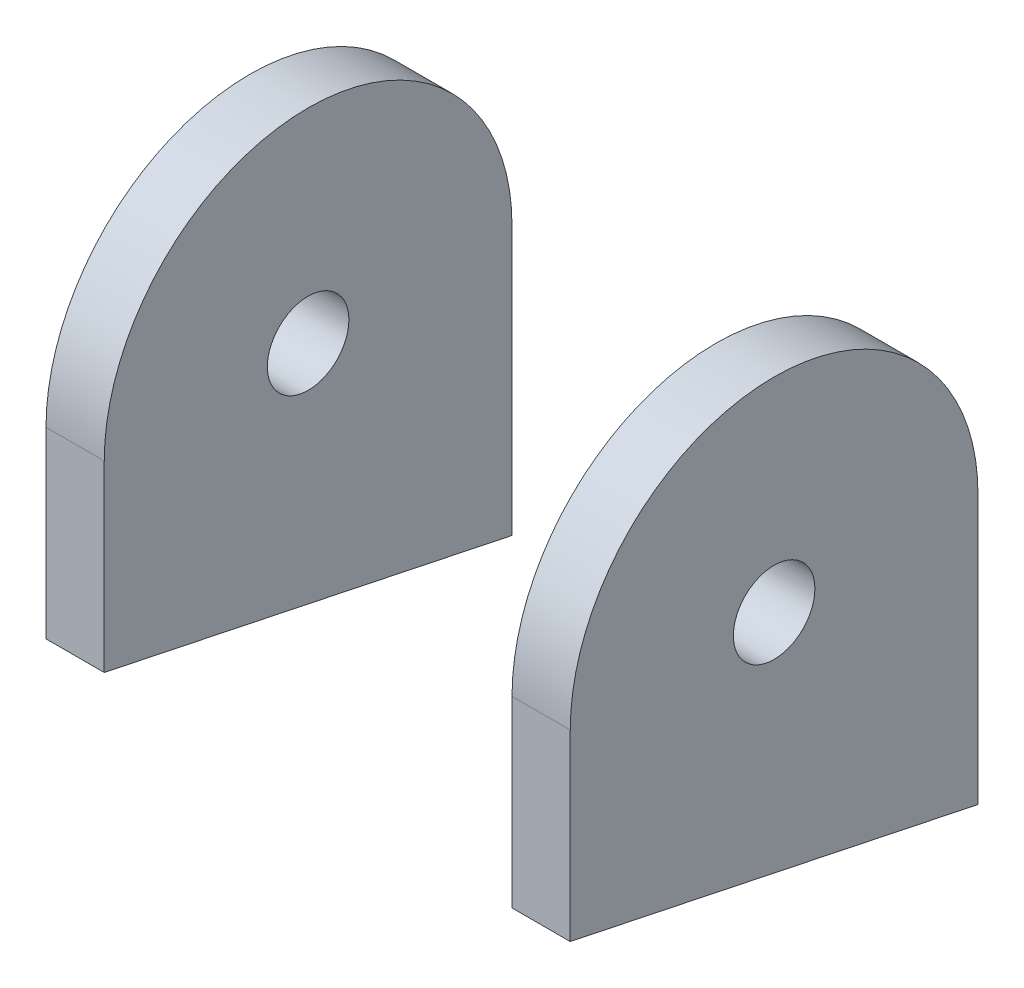
ISO-10303-21;
HEADER;
FILE_DESCRIPTION(('STEP AP214'),'2;1');
FILE_NAME('part.step','',(''),(''),'','','');
FILE_SCHEMA(('AUTOMOTIVE_DESIGN { 1 0 10303 214 1 1 1 1 }'));
ENDSEC;
DATA;
#1=APPLICATION_CONTEXT('core data for automotive mechanical design processes');
#2=APPLICATION_PROTOCOL_DEFINITION('international standard','automotive_design',2000,#1);
#3=PRODUCT_CONTEXT('',#1,'mechanical');
#4=PRODUCT('Part','Part','',(#3));
#5=PRODUCT_RELATED_PRODUCT_CATEGORY('part','',(#4));
#6=PRODUCT_DEFINITION_FORMATION('','',#4);
#7=PRODUCT_DEFINITION_CONTEXT('part definition',#1,'design');
#8=PRODUCT_DEFINITION('design','',#6,#7);
#9=PRODUCT_DEFINITION_SHAPE('','',#8);
#10=(LENGTH_UNIT() NAMED_UNIT(*) SI_UNIT(.MILLI.,.METRE.));
#11=(NAMED_UNIT(*) PLANE_ANGLE_UNIT() SI_UNIT($,.RADIAN.));
#12=(NAMED_UNIT(*) SI_UNIT($,.STERADIAN.) SOLID_ANGLE_UNIT());
#13=UNCERTAINTY_MEASURE_WITH_UNIT(LENGTH_MEASURE(1.E-05),#10,'distance_accuracy_value','');
#14=(GEOMETRIC_REPRESENTATION_CONTEXT(3) GLOBAL_UNCERTAINTY_ASSIGNED_CONTEXT((#13)) GLOBAL_UNIT_ASSIGNED_CONTEXT((#10,
#11,#12)) REPRESENTATION_CONTEXT('',''));
#15=CARTESIAN_POINT('',(0.,0.,0.));
#16=DIRECTION('',(0.,0.,1.));
#17=DIRECTION('',(1.,0.,0.));
#18=AXIS2_PLACEMENT_3D('',#15,#16,#17);
#19=CARTESIAN_POINT('',(-80.,0.,0.));
#20=DIRECTION('',(1.,0.,0.));
#21=DIRECTION('',(0.,0.,-1.));
#22=AXIS2_PLACEMENT_3D('',#19,#20,#21);
#23=CYLINDRICAL_SURFACE('',#22,35.);
#24=DIRECTION('',(1.,0.,0.));
#25=VECTOR('',#24,1.);
#26=CARTESIAN_POINT('',(-80.,0.,35.));
#27=LINE('',#26,#25);
#28=CARTESIAN_POINT('',(-80.,0.,35.));
#29=VERTEX_POINT('',#28);
#30=CARTESIAN_POINT('',(-70.,0.,35.));
#31=VERTEX_POINT('',#30);
#32=EDGE_CURVE('E111',#29,#31,#27,.T.);
#33=ORIENTED_EDGE('',*,*,#32,.T.);
#34=CARTESIAN_POINT('',(-70.,0.,0.));
#35=DIRECTION('',(1.,0.,0.));
#36=DIRECTION('',(0.,0.,-1.));
#37=AXIS2_PLACEMENT_3D('',#34,#35,#36);
#38=CIRCLE('',#37,35.);
#39=CARTESIAN_POINT('',(-70.,0.,-35.));
#40=VERTEX_POINT('',#39);
#41=EDGE_CURVE('E97',#40,#31,#38,.T.);
#42=ORIENTED_EDGE('',*,*,#41,.F.);
#43=DIRECTION('',(1.,0.,0.));
#44=VECTOR('',#43,1.);
#45=CARTESIAN_POINT('',(-80.,0.,-35.));
#46=LINE('',#45,#44);
#47=CARTESIAN_POINT('',(-80.,0.,-35.));
#48=VERTEX_POINT('',#47);
#49=EDGE_CURVE('E107',#48,#40,#46,.T.);
#50=ORIENTED_EDGE('',*,*,#49,.F.);
#51=CARTESIAN_POINT('',(-80.,0.,0.));
#52=DIRECTION('',(1.,0.,0.));
#53=DIRECTION('',(0.,0.,-1.));
#54=AXIS2_PLACEMENT_3D('',#51,#52,#53);
#55=CIRCLE('',#54,35.);
#56=EDGE_CURVE('E110',#48,#29,#55,.T.);
#57=ORIENTED_EDGE('',*,*,#56,.T.);
#58=EDGE_LOOP('',(#33,#42,#50,#57));
#59=FACE_BOUND('',#58,.T.);
#60=ADVANCED_FACE('F45',(#59),#23,.T.);
#61=CARTESIAN_POINT('',(-80.,0.,-35.));
#62=DIRECTION('',(0.,0.,-1.));
#63=DIRECTION('',(0.,1.,0.));
#64=AXIS2_PLACEMENT_3D('',#61,#62,#63);
#65=PLANE('',#64);
#66=DIRECTION('',(1.,0.,0.));
#67=VECTOR('',#66,1.);
#68=CARTESIAN_POINT('',(-80.,-46.0800024246072,-35.));
#69=LINE('',#68,#67);
#70=CARTESIAN_POINT('',(-80.,-46.0800024246072,-35.));
#71=VERTEX_POINT('',#70);
#72=CARTESIAN_POINT('',(-70.,-46.0800024246072,-35.));
#73=VERTEX_POINT('',#72);
#74=EDGE_CURVE('E59',#71,#73,#69,.T.);
#75=ORIENTED_EDGE('',*,*,#74,.F.);
#76=DIRECTION('',(0.,1.,0.));
#77=VECTOR('',#76,1.);
#78=CARTESIAN_POINT('',(-80.,0.,-35.));
#79=LINE('',#78,#77);
#80=EDGE_CURVE('E109',#71,#48,#79,.T.);
#81=ORIENTED_EDGE('',*,*,#80,.T.);
#82=ORIENTED_EDGE('',*,*,#49,.T.);
#83=DIRECTION('',(0.,1.,0.));
#84=VECTOR('',#83,1.);
#85=CARTESIAN_POINT('',(-70.,0.,-35.));
#86=LINE('',#85,#84);
#87=EDGE_CURVE('E53',#73,#40,#86,.T.);
#88=ORIENTED_EDGE('',*,*,#87,.F.);
#89=EDGE_LOOP('',(#75,#81,#82,#88));
#90=FACE_BOUND('',#89,.T.);
#91=ADVANCED_FACE('F140',(#90),#65,.T.);
#92=CARTESIAN_POINT('',(-80.,0.,35.));
#93=DIRECTION('',(0.,0.,1.));
#94=DIRECTION('',(1.,0.,0.));
#95=AXIS2_PLACEMENT_3D('',#92,#93,#94);
#96=PLANE('',#95);
#97=DIRECTION('',(-1.,0.,0.));
#98=VECTOR('',#97,1.);
#99=CARTESIAN_POINT('',(-80.,-31.4519974855182,35.));
#100=LINE('',#99,#98);
#101=CARTESIAN_POINT('',(-70.,-31.4519974855182,35.));
#102=VERTEX_POINT('',#101);
#103=CARTESIAN_POINT('',(-80.,-31.4519974855182,35.));
#104=VERTEX_POINT('',#103);
#105=EDGE_CURVE('E83',#102,#104,#100,.T.);
#106=ORIENTED_EDGE('',*,*,#105,.F.);
#107=DIRECTION('',(0.,-1.,0.));
#108=VECTOR('',#107,1.);
#109=CARTESIAN_POINT('',(-70.,0.,35.));
#110=LINE('',#109,#108);
#111=EDGE_CURVE('E90',#31,#102,#110,.T.);
#112=ORIENTED_EDGE('',*,*,#111,.F.);
#113=ORIENTED_EDGE('',*,*,#32,.F.);
#114=DIRECTION('',(0.,-1.,0.));
#115=VECTOR('',#114,1.);
#116=CARTESIAN_POINT('',(-80.,0.,35.));
#117=LINE('',#116,#115);
#118=EDGE_CURVE('E93',#29,#104,#117,.T.);
#119=ORIENTED_EDGE('',*,*,#118,.T.);
#120=EDGE_LOOP('',(#106,#112,#113,#119));
#121=FACE_BOUND('',#120,.T.);
#122=ADVANCED_FACE('F89',(#121),#96,.T.);
#123=CARTESIAN_POINT('',(-80.,0.,0.));
#124=DIRECTION('',(1.,0.,0.));
#125=DIRECTION('',(0.,0.,-1.));
#126=AXIS2_PLACEMENT_3D('',#123,#124,#125);
#127=CYLINDRICAL_SURFACE('',#126,7.);
#128=CARTESIAN_POINT('',(-80.,0.,0.));
#129=DIRECTION('',(1.,0.,0.));
#130=DIRECTION('',(0.,0.,-1.));
#131=AXIS2_PLACEMENT_3D('',#128,#129,#130);
#132=CIRCLE('',#131,7.);
#133=CARTESIAN_POINT('',(-80.,0.,-7.));
#134=VERTEX_POINT('',#133);
#135=EDGE_CURVE('E100',#134,#134,#132,.T.);
#136=ORIENTED_EDGE('',*,*,#135,.F.);
#137=EDGE_LOOP('',(#136));
#138=FACE_BOUND('',#137,.T.);
#139=CARTESIAN_POINT('',(-70.,0.,0.));
#140=DIRECTION('',(1.,0.,0.));
#141=DIRECTION('',(0.,0.,-1.));
#142=AXIS2_PLACEMENT_3D('',#139,#140,#141);
#143=CIRCLE('',#142,7.);
#144=CARTESIAN_POINT('',(-70.,0.,-7.));
#145=VERTEX_POINT('',#144);
#146=EDGE_CURVE('E104',#145,#145,#143,.T.);
#147=ORIENTED_EDGE('',*,*,#146,.T.);
#148=EDGE_LOOP('',(#147));
#149=FACE_BOUND('',#148,.T.);
#150=ADVANCED_FACE('F47',(#138,#149),#127,.F.);
#151=CARTESIAN_POINT('',(-80.,0.,0.));
#152=DIRECTION('',(1.,0.,0.));
#153=DIRECTION('',(0.,0.,-1.));
#154=AXIS2_PLACEMENT_3D('',#151,#152,#153);
#155=PLANE('',#154);
#156=ORIENTED_EDGE('',*,*,#135,.T.);
#157=EDGE_LOOP('',(#156));
#158=FACE_BOUND('',#157,.T.);
#159=ORIENTED_EDGE('',*,*,#80,.F.);
#160=DIRECTION('',(0.,0.204552903383942,0.978855510132726));
#161=VECTOR('',#160,1.);
#162=CARTESIAN_POINT('',(-80.,-37.1439572382399,7.76202842768976));
#163=LINE('',#162,#161);
#164=EDGE_CURVE('E112',#71,#104,#163,.T.);
#165=ORIENTED_EDGE('',*,*,#164,.T.);
#166=ORIENTED_EDGE('',*,*,#118,.F.);
#167=ORIENTED_EDGE('',*,*,#56,.F.);
#168=EDGE_LOOP('',(#159,#165,#166,#167));
#169=FACE_BOUND('',#168,.T.);
#170=ADVANCED_FACE('F125',(#158,#169),#155,.F.);
#171=CARTESIAN_POINT('',(-70.,0.,0.));
#172=DIRECTION('',(1.,0.,0.));
#173=DIRECTION('',(0.,0.,-1.));
#174=AXIS2_PLACEMENT_3D('',#171,#172,#173);
#175=PLANE('',#174);
#176=DIRECTION('',(0.,0.204552903383942,0.978855510132726));
#177=VECTOR('',#176,1.);
#178=CARTESIAN_POINT('',(-70.,-37.1439572382399,7.76202842768976));
#179=LINE('',#178,#177);
#180=EDGE_CURVE('E12',#73,#102,#179,.T.);
#181=ORIENTED_EDGE('',*,*,#180,.F.);
#182=ORIENTED_EDGE('',*,*,#87,.T.);
#183=ORIENTED_EDGE('',*,*,#41,.T.);
#184=ORIENTED_EDGE('',*,*,#111,.T.);
#185=EDGE_LOOP('',(#181,#182,#183,#184));
#186=FACE_BOUND('',#185,.T.);
#187=ORIENTED_EDGE('',*,*,#146,.F.);
#188=EDGE_LOOP('',(#187));
#189=FACE_BOUND('',#188,.T.);
#190=ADVANCED_FACE('F95',(#186,#189),#175,.T.);
#191=CARTESIAN_POINT('',(0.,-37.1439572382399,7.76202842768975));
#192=DIRECTION('',(0.,0.978855510132726,-0.204552903383942));
#193=DIRECTION('',(0.,0.204552903383942,0.978855510132726));
#194=AXIS2_PLACEMENT_3D('',#191,#192,#193);
#195=PLANE('',#194);
#196=ORIENTED_EDGE('',*,*,#74,.T.);
#197=ORIENTED_EDGE('',*,*,#180,.T.);
#198=ORIENTED_EDGE('',*,*,#105,.T.);
#199=ORIENTED_EDGE('',*,*,#164,.F.);
#200=EDGE_LOOP('',(#196,#197,#198,#199));
#201=FACE_BOUND('',#200,.T.);
#202=ADVANCED_FACE('F82',(#201),#195,.F.);
#203=CLOSED_SHELL('',(#60,#91,#122,#150,#170,#190,#202));
#204=MANIFOLD_SOLID_BREP('B2',#203);
#205=CARTESIAN_POINT('',(-80.,0.,35.));
#206=DIRECTION('',(0.,0.,1.));
#207=DIRECTION('',(1.,0.,0.));
#208=AXIS2_PLACEMENT_3D('',#205,#206,#207);
#209=PLANE('',#208);
#210=DIRECTION('',(-1.,0.,0.));
#211=VECTOR('',#210,1.);
#212=CARTESIAN_POINT('',(-80.,-31.4519974855182,35.));
#213=LINE('',#212,#211);
#214=CARTESIAN_POINT('',(9.99999999999999,-31.4519974855182,35.));
#215=VERTEX_POINT('',#214);
#216=CARTESIAN_POINT('',(0.,-31.4519974855182,35.));
#217=VERTEX_POINT('',#216);
#218=EDGE_CURVE('E205',#215,#217,#213,.T.);
#219=ORIENTED_EDGE('',*,*,#218,.F.);
#220=DIRECTION('',(0.,-1.,0.));
#221=VECTOR('',#220,1.);
#222=CARTESIAN_POINT('',(10.,0.,35.));
#223=LINE('',#222,#221);
#224=CARTESIAN_POINT('',(10.,0.,35.));
#225=VERTEX_POINT('',#224);
#226=EDGE_CURVE('E254',#225,#215,#223,.T.);
#227=ORIENTED_EDGE('',*,*,#226,.F.);
#228=DIRECTION('',(1.,0.,0.));
#229=VECTOR('',#228,1.);
#230=CARTESIAN_POINT('',(-80.,0.,35.));
#231=LINE('',#230,#229);
#232=CARTESIAN_POINT('',(0.,0.,35.));
#233=VERTEX_POINT('',#232);
#234=EDGE_CURVE('E258',#233,#225,#231,.T.);
#235=ORIENTED_EDGE('',*,*,#234,.F.);
#236=DIRECTION('',(0.,-1.,0.));
#237=VECTOR('',#236,1.);
#238=CARTESIAN_POINT('',(0.,0.,35.));
#239=LINE('',#238,#237);
#240=EDGE_CURVE('E245',#233,#217,#239,.T.);
#241=ORIENTED_EDGE('',*,*,#240,.T.);
#242=EDGE_LOOP('',(#219,#227,#235,#241));
#243=FACE_BOUND('',#242,.T.);
#244=ADVANCED_FACE('F190',(#243),#209,.T.);
#245=CARTESIAN_POINT('',(-80.,0.,-35.));
#246=DIRECTION('',(0.,0.,-1.));
#247=DIRECTION('',(0.,1.,0.));
#248=AXIS2_PLACEMENT_3D('',#245,#246,#247);
#249=PLANE('',#248);
#250=DIRECTION('',(1.,0.,0.));
#251=VECTOR('',#250,1.);
#252=CARTESIAN_POINT('',(-80.,-46.0800024246072,-35.));
#253=LINE('',#252,#251);
#254=CARTESIAN_POINT('',(0.,-46.0800024246072,-35.));
#255=VERTEX_POINT('',#254);
#256=CARTESIAN_POINT('',(9.99999999999999,-46.0800024246071,-35.));
#257=VERTEX_POINT('',#256);
#258=EDGE_CURVE('E231',#255,#257,#253,.T.);
#259=ORIENTED_EDGE('',*,*,#258,.F.);
#260=DIRECTION('',(0.,1.,0.));
#261=VECTOR('',#260,1.);
#262=CARTESIAN_POINT('',(0.,0.,-35.));
#263=LINE('',#262,#261);
#264=CARTESIAN_POINT('',(0.,0.,-35.));
#265=VERTEX_POINT('',#264);
#266=EDGE_CURVE('E237',#255,#265,#263,.T.);
#267=ORIENTED_EDGE('',*,*,#266,.T.);
#268=DIRECTION('',(1.,0.,0.));
#269=VECTOR('',#268,1.);
#270=CARTESIAN_POINT('',(-80.,0.,-35.));
#271=LINE('',#270,#269);
#272=CARTESIAN_POINT('',(10.,0.,-35.));
#273=VERTEX_POINT('',#272);
#274=EDGE_CURVE('E198',#265,#273,#271,.T.);
#275=ORIENTED_EDGE('',*,*,#274,.T.);
#276=DIRECTION('',(0.,1.,0.));
#277=VECTOR('',#276,1.);
#278=CARTESIAN_POINT('',(10.,0.,-35.));
#279=LINE('',#278,#277);
#280=EDGE_CURVE('E212',#257,#273,#279,.T.);
#281=ORIENTED_EDGE('',*,*,#280,.F.);
#282=EDGE_LOOP('',(#259,#267,#275,#281));
#283=FACE_BOUND('',#282,.T.);
#284=ADVANCED_FACE('F236',(#283),#249,.T.);
#285=CARTESIAN_POINT('',(-80.,0.,0.));
#286=DIRECTION('',(1.,0.,0.));
#287=DIRECTION('',(0.,0.,-1.));
#288=AXIS2_PLACEMENT_3D('',#285,#286,#287);
#289=CYLINDRICAL_SURFACE('',#288,35.);
#290=CARTESIAN_POINT('',(0.,0.,0.));
#291=DIRECTION('',(1.,0.,0.));
#292=DIRECTION('',(0.,0.,-1.));
#293=AXIS2_PLACEMENT_3D('',#290,#291,#292);
#294=CIRCLE('',#293,35.);
#295=EDGE_CURVE('E242',#265,#233,#294,.T.);
#296=ORIENTED_EDGE('',*,*,#295,.T.);
#297=ORIENTED_EDGE('',*,*,#234,.T.);
#298=CARTESIAN_POINT('',(10.,0.,0.));
#299=DIRECTION('',(1.,0.,0.));
#300=DIRECTION('',(0.,0.,-1.));
#301=AXIS2_PLACEMENT_3D('',#298,#299,#300);
#302=CIRCLE('',#301,35.);
#303=EDGE_CURVE('E248',#273,#225,#302,.T.);
#304=ORIENTED_EDGE('',*,*,#303,.F.);
#305=ORIENTED_EDGE('',*,*,#274,.F.);
#306=EDGE_LOOP('',(#296,#297,#304,#305));
#307=FACE_BOUND('',#306,.T.);
#308=ADVANCED_FACE('F192',(#307),#289,.T.);
#309=CARTESIAN_POINT('',(10.,0.,0.));
#310=DIRECTION('',(1.,0.,0.));
#311=DIRECTION('',(0.,0.,-1.));
#312=AXIS2_PLACEMENT_3D('',#309,#310,#311);
#313=PLANE('',#312);
#314=DIRECTION('',(0.,0.204552903383942,0.978855510132726));
#315=VECTOR('',#314,1.);
#316=CARTESIAN_POINT('',(10.,-37.1439572382399,7.76202842768975));
#317=LINE('',#316,#315);
#318=EDGE_CURVE('E266',#257,#215,#317,.T.);
#319=ORIENTED_EDGE('',*,*,#318,.F.);
#320=ORIENTED_EDGE('',*,*,#280,.T.);
#321=ORIENTED_EDGE('',*,*,#303,.T.);
#322=ORIENTED_EDGE('',*,*,#226,.T.);
#323=EDGE_LOOP('',(#319,#320,#321,#322));
#324=FACE_BOUND('',#323,.T.);
#325=CARTESIAN_POINT('',(10.,0.,0.));
#326=DIRECTION('',(1.,0.,0.));
#327=DIRECTION('',(0.,0.,-1.));
#328=AXIS2_PLACEMENT_3D('',#325,#326,#327);
#329=CIRCLE('',#328,7.);
#330=CARTESIAN_POINT('',(10.,0.,-7.));
#331=VERTEX_POINT('',#330);
#332=EDGE_CURVE('E244',#331,#331,#329,.T.);
#333=ORIENTED_EDGE('',*,*,#332,.F.);
#334=EDGE_LOOP('',(#333));
#335=FACE_BOUND('',#334,.T.);
#336=ADVANCED_FACE('F264',(#324,#335),#313,.T.);
#337=CARTESIAN_POINT('',(-80.,0.,0.));
#338=DIRECTION('',(1.,0.,0.));
#339=DIRECTION('',(0.,0.,-1.));
#340=AXIS2_PLACEMENT_3D('',#337,#338,#339);
#341=CYLINDRICAL_SURFACE('',#340,7.);
#342=CARTESIAN_POINT('',(0.,0.,0.));
#343=DIRECTION('',(1.,0.,0.));
#344=DIRECTION('',(0.,0.,-1.));
#345=AXIS2_PLACEMENT_3D('',#342,#343,#344);
#346=CIRCLE('',#345,7.);
#347=CARTESIAN_POINT('',(0.,0.,-7.));
#348=VERTEX_POINT('',#347);
#349=EDGE_CURVE('E328',#348,#348,#346,.T.);
#350=ORIENTED_EDGE('',*,*,#349,.F.);
#351=EDGE_LOOP('',(#350));
#352=FACE_BOUND('',#351,.T.);
#353=ORIENTED_EDGE('',*,*,#332,.T.);
#354=EDGE_LOOP('',(#353));
#355=FACE_BOUND('',#354,.T.);
#356=ADVANCED_FACE('F268',(#352,#355),#341,.F.);
#357=CARTESIAN_POINT('',(0.,0.,0.));
#358=DIRECTION('',(1.,0.,0.));
#359=DIRECTION('',(0.,0.,-1.));
#360=AXIS2_PLACEMENT_3D('',#357,#358,#359);
#361=PLANE('',#360);
#362=ORIENTED_EDGE('',*,*,#349,.T.);
#363=EDGE_LOOP('',(#362));
#364=FACE_BOUND('',#363,.T.);
#365=ORIENTED_EDGE('',*,*,#266,.F.);
#366=DIRECTION('',(0.,0.204552903383942,0.978855510132726));
#367=VECTOR('',#366,1.);
#368=CARTESIAN_POINT('',(0.,-37.1439572382399,7.76202842768975));
#369=LINE('',#368,#367);
#370=EDGE_CURVE('E43',#255,#217,#369,.T.);
#371=ORIENTED_EDGE('',*,*,#370,.T.);
#372=ORIENTED_EDGE('',*,*,#240,.F.);
#373=ORIENTED_EDGE('',*,*,#295,.F.);
#374=EDGE_LOOP('',(#365,#371,#372,#373));
#375=FACE_BOUND('',#374,.T.);
#376=ADVANCED_FACE('F240',(#364,#375),#361,.F.);
#377=CARTESIAN_POINT('',(0.,-37.1439572382399,7.76202842768975));
#378=DIRECTION('',(0.,0.978855510132726,-0.204552903383942));
#379=DIRECTION('',(0.,0.204552903383942,0.978855510132726));
#380=AXIS2_PLACEMENT_3D('',#377,#378,#379);
#381=PLANE('',#380);
#382=ORIENTED_EDGE('',*,*,#318,.T.);
#383=ORIENTED_EDGE('',*,*,#218,.T.);
#384=ORIENTED_EDGE('',*,*,#370,.F.);
#385=ORIENTED_EDGE('',*,*,#258,.T.);
#386=EDGE_LOOP('',(#382,#383,#384,#385));
#387=FACE_BOUND('',#386,.T.);
#388=ADVANCED_FACE('F230',(#387),#381,.F.);
#389=CLOSED_SHELL('',(#244,#284,#308,#336,#356,#376,#388));
#390=MANIFOLD_SOLID_BREP('B6',#389);
#391=ADVANCED_BREP_SHAPE_REPRESENTATION('',(#18,#204,#390),#14);
#392=SHAPE_DEFINITION_REPRESENTATION(#9,#391);
ENDSEC;
END-ISO-10303-21;
